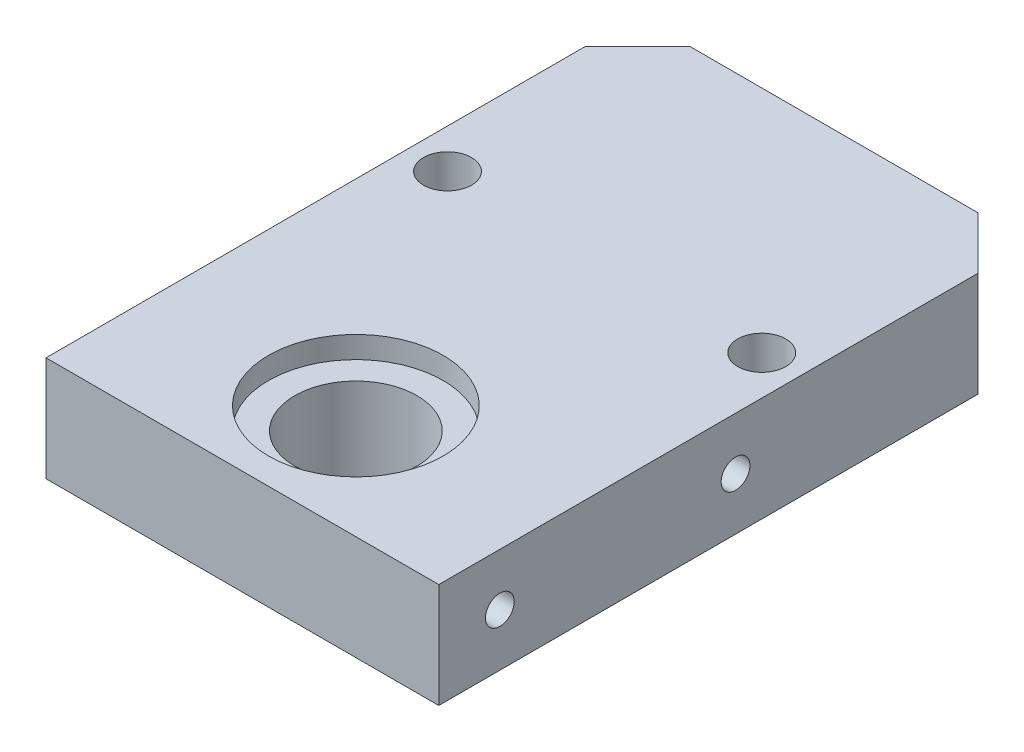
ISO-10303-21;
HEADER;
FILE_DESCRIPTION(('STEP AP214'),'2;1');
FILE_NAME('part.step','',(''),(''),'','','');
FILE_SCHEMA(('AUTOMOTIVE_DESIGN { 1 0 10303 214 1 1 1 1 }'));
ENDSEC;
DATA;
#1=APPLICATION_CONTEXT('core data for automotive mechanical design processes');
#2=APPLICATION_PROTOCOL_DEFINITION('international standard','automotive_design',2000,#1);
#3=PRODUCT_CONTEXT('',#1,'mechanical');
#4=PRODUCT('Part','Part','',(#3));
#5=PRODUCT_RELATED_PRODUCT_CATEGORY('part','',(#4));
#6=PRODUCT_DEFINITION_FORMATION('','',#4);
#7=PRODUCT_DEFINITION_CONTEXT('part definition',#1,'design');
#8=PRODUCT_DEFINITION('design','',#6,#7);
#9=PRODUCT_DEFINITION_SHAPE('','',#8);
#10=(LENGTH_UNIT() NAMED_UNIT(*) SI_UNIT(.MILLI.,.METRE.));
#11=(NAMED_UNIT(*) PLANE_ANGLE_UNIT() SI_UNIT($,.RADIAN.));
#12=(NAMED_UNIT(*) SI_UNIT($,.STERADIAN.) SOLID_ANGLE_UNIT());
#13=UNCERTAINTY_MEASURE_WITH_UNIT(LENGTH_MEASURE(1.E-05),#10,'distance_accuracy_value','');
#14=(GEOMETRIC_REPRESENTATION_CONTEXT(3) GLOBAL_UNCERTAINTY_ASSIGNED_CONTEXT((#13)) GLOBAL_UNIT_ASSIGNED_CONTEXT((#10,
#11,#12)) REPRESENTATION_CONTEXT('',''));
#15=CARTESIAN_POINT('',(0.,0.,0.));
#16=DIRECTION('',(0.,0.,1.));
#17=DIRECTION('',(1.,0.,0.));
#18=AXIS2_PLACEMENT_3D('',#15,#16,#17);
#19=CARTESIAN_POINT('',(0.,12.,20.8888888888888));
#20=DIRECTION('',(0.,-1.,0.));
#21=DIRECTION('',(0.,0.,-1.));
#22=AXIS2_PLACEMENT_3D('',#19,#20,#21);
#23=CYLINDRICAL_SURFACE('',#22,7.);
#24=CARTESIAN_POINT('',(0.,0.,20.8888888888888));
#25=DIRECTION('',(0.,1.,0.));
#26=DIRECTION('',(0.,0.,1.));
#27=AXIS2_PLACEMENT_3D('',#24,#25,#26);
#28=CIRCLE('',#27,7.);
#29=CARTESIAN_POINT('',(0.,0.,27.8888888888888));
#30=VERTEX_POINT('',#29);
#31=EDGE_CURVE('E220',#30,#30,#28,.T.);
#32=ORIENTED_EDGE('',*,*,#31,.F.);
#33=EDGE_LOOP('',(#32));
#34=FACE_BOUND('',#33,.T.);
#35=CARTESIAN_POINT('',(0.,9.5,20.8888888888888));
#36=DIRECTION('',(0.,1.,0.));
#37=DIRECTION('',(0.,0.,1.));
#38=AXIS2_PLACEMENT_3D('',#35,#36,#37);
#39=CIRCLE('',#38,7.);
#40=CARTESIAN_POINT('',(0.,9.5,27.8888888888888));
#41=VERTEX_POINT('',#40);
#42=EDGE_CURVE('E49',#41,#41,#39,.T.);
#43=ORIENTED_EDGE('',*,*,#42,.T.);
#44=EDGE_LOOP('',(#43));
#45=FACE_BOUND('',#44,.T.);
#46=ADVANCED_FACE('F45',(#34,#45),#23,.F.);
#47=CARTESIAN_POINT('',(-22.5,12.,33.8888888888888));
#48=DIRECTION('',(1.,0.,0.));
#49=DIRECTION('',(0.,0.,-1.));
#50=AXIS2_PLACEMENT_3D('',#47,#48,#49);
#51=PLANE('',#50);
#52=CARTESIAN_POINT('',(-22.5,6.,-0.111111111111159));
#53=DIRECTION('',(-1.,0.,0.));
#54=DIRECTION('',(0.,0.,1.));
#55=AXIS2_PLACEMENT_3D('',#52,#53,#54);
#56=CIRCLE('',#55,1.65);
#57=CARTESIAN_POINT('',(-22.5,6.,1.53888888888884));
#58=VERTEX_POINT('',#57);
#59=EDGE_CURVE('E259',#58,#58,#56,.T.);
#60=ORIENTED_EDGE('',*,*,#59,.F.);
#61=EDGE_LOOP('',(#60));
#62=FACE_BOUND('',#61,.T.);
#63=DIRECTION('',(0.,0.,1.));
#64=VECTOR('',#63,1.);
#65=CARTESIAN_POINT('',(-22.5,0.,33.8888888888888));
#66=LINE('',#65,#64);
#67=CARTESIAN_POINT('',(-22.5,0.,-27.8888888888888));
#68=VERTEX_POINT('',#67);
#69=CARTESIAN_POINT('',(-22.5,0.,33.8888888888888));
#70=VERTEX_POINT('',#69);
#71=EDGE_CURVE('E140',#68,#70,#66,.T.);
#72=ORIENTED_EDGE('',*,*,#71,.T.);
#73=DIRECTION('',(0.,-1.,0.));
#74=VECTOR('',#73,1.);
#75=CARTESIAN_POINT('',(-22.5,12.,33.8888888888888));
#76=LINE('',#75,#74);
#77=CARTESIAN_POINT('',(-22.5,12.,33.8888888888888));
#78=VERTEX_POINT('',#77);
#79=EDGE_CURVE('E11',#78,#70,#76,.T.);
#80=ORIENTED_EDGE('',*,*,#79,.F.);
#81=DIRECTION('',(0.,0.,1.));
#82=VECTOR('',#81,1.);
#83=CARTESIAN_POINT('',(-22.5,12.,33.8888888888888));
#84=LINE('',#83,#82);
#85=CARTESIAN_POINT('',(-22.5,12.,-27.8888888888888));
#86=VERTEX_POINT('',#85);
#87=EDGE_CURVE('E157',#86,#78,#84,.T.);
#88=ORIENTED_EDGE('',*,*,#87,.F.);
#89=DIRECTION('',(0.,-1.,0.));
#90=VECTOR('',#89,1.);
#91=CARTESIAN_POINT('',(-22.5,12.,-27.8888888888888));
#92=LINE('',#91,#90);
#93=EDGE_CURVE('E136',#86,#68,#92,.T.);
#94=ORIENTED_EDGE('',*,*,#93,.T.);
#95=EDGE_LOOP('',(#72,#80,#88,#94));
#96=FACE_BOUND('',#95,.T.);
#97=CARTESIAN_POINT('',(-22.5,6.,26.8888888888888));
#98=DIRECTION('',(-1.,0.,0.));
#99=DIRECTION('',(0.,0.,1.));
#100=AXIS2_PLACEMENT_3D('',#97,#98,#99);
#101=CIRCLE('',#100,1.65);
#102=CARTESIAN_POINT('',(-22.5,6.,28.5388888888888));
#103=VERTEX_POINT('',#102);
#104=EDGE_CURVE('E251',#103,#103,#101,.T.);
#105=ORIENTED_EDGE('',*,*,#104,.F.);
#106=EDGE_LOOP('',(#105));
#107=FACE_BOUND('',#106,.T.);
#108=ADVANCED_FACE('F47',(#62,#96,#107),#51,.F.);
#109=CARTESIAN_POINT('',(0.,12.,0.));
#110=DIRECTION('',(0.,-1.,0.));
#111=DIRECTION('',(0.,0.,-1.));
#112=AXIS2_PLACEMENT_3D('',#109,#110,#111);
#113=PLANE('',#112);
#114=CARTESIAN_POINT('',(0.,12.,20.8888888888888));
#115=DIRECTION('',(0.,1.,0.));
#116=DIRECTION('',(0.,0.,1.));
#117=AXIS2_PLACEMENT_3D('',#114,#115,#116);
#118=CIRCLE('',#117,10.);
#119=CARTESIAN_POINT('',(0.,12.,30.8888888888888));
#120=VERTEX_POINT('',#119);
#121=EDGE_CURVE('E279',#120,#120,#118,.T.);
#122=ORIENTED_EDGE('',*,*,#121,.F.);
#123=EDGE_LOOP('',(#122));
#124=FACE_BOUND('',#123,.T.);
#125=ORIENTED_EDGE('',*,*,#87,.T.);
#126=DIRECTION('',(1.,0.,0.));
#127=VECTOR('',#126,1.);
#128=CARTESIAN_POINT('',(-22.5,12.,33.8888888888888));
#129=LINE('',#128,#127);
#130=CARTESIAN_POINT('',(22.5,12.,33.8888888888888));
#131=VERTEX_POINT('',#130);
#132=EDGE_CURVE('E102',#78,#131,#129,.T.);
#133=ORIENTED_EDGE('',*,*,#132,.T.);
#134=DIRECTION('',(0.,0.,-1.));
#135=VECTOR('',#134,1.);
#136=CARTESIAN_POINT('',(22.5,12.,33.8888888888888));
#137=LINE('',#136,#135);
#138=CARTESIAN_POINT('',(22.5,12.,-27.8888888888888));
#139=VERTEX_POINT('',#138);
#140=EDGE_CURVE('E118',#131,#139,#137,.T.);
#141=ORIENTED_EDGE('',*,*,#140,.T.);
#142=DIRECTION('',(-0.707106781186544,0.,-0.707106781186552));
#143=VECTOR('',#142,1.);
#144=CARTESIAN_POINT('',(16.5000000000001,12.,-33.8888888888888));
#145=LINE('',#144,#143);
#146=CARTESIAN_POINT('',(16.5000000000001,12.,-33.8888888888888));
#147=VERTEX_POINT('',#146);
#148=EDGE_CURVE('E111',#139,#147,#145,.T.);
#149=ORIENTED_EDGE('',*,*,#148,.T.);
#150=DIRECTION('',(-1.,0.,0.));
#151=VECTOR('',#150,1.);
#152=CARTESIAN_POINT('',(-16.5000000000001,12.,-33.8888888888888));
#153=LINE('',#152,#151);
#154=CARTESIAN_POINT('',(-16.5000000000001,12.,-33.8888888888888));
#155=VERTEX_POINT('',#154);
#156=EDGE_CURVE('E116',#147,#155,#153,.T.);
#157=ORIENTED_EDGE('',*,*,#156,.T.);
#158=DIRECTION('',(-0.707106781186543,0.,0.707106781186552));
#159=VECTOR('',#158,1.);
#160=CARTESIAN_POINT('',(-16.5000000000001,12.,-33.8888888888888));
#161=LINE('',#160,#159);
#162=EDGE_CURVE('E64',#155,#86,#161,.T.);
#163=ORIENTED_EDGE('',*,*,#162,.T.);
#164=EDGE_LOOP('',(#125,#133,#141,#149,#157,#163));
#165=FACE_BOUND('',#164,.T.);
#166=CARTESIAN_POINT('',(-18.,12.,-7.61111111111116));
#167=DIRECTION('',(0.,1.,0.));
#168=DIRECTION('',(0.,0.,1.));
#169=AXIS2_PLACEMENT_3D('',#166,#167,#168);
#170=CIRCLE('',#169,2.75);
#171=CARTESIAN_POINT('',(-18.,12.,-4.86111111111116));
#172=VERTEX_POINT('',#171);
#173=EDGE_CURVE('E145',#172,#172,#170,.T.);
#174=ORIENTED_EDGE('',*,*,#173,.F.);
#175=EDGE_LOOP('',(#174));
#176=FACE_BOUND('',#175,.T.);
#177=CARTESIAN_POINT('',(18.,12.,-7.61111111111116));
#178=DIRECTION('',(0.,1.,0.));
#179=DIRECTION('',(0.,0.,1.));
#180=AXIS2_PLACEMENT_3D('',#177,#178,#179);
#181=CIRCLE('',#180,2.75);
#182=CARTESIAN_POINT('',(18.,12.,-4.86111111111116));
#183=VERTEX_POINT('',#182);
#184=EDGE_CURVE('E219',#183,#183,#181,.T.);
#185=ORIENTED_EDGE('',*,*,#184,.F.);
#186=EDGE_LOOP('',(#185));
#187=FACE_BOUND('',#186,.T.);
#188=ADVANCED_FACE('F113',(#124,#165,#176,#187),#113,.F.);
#189=CARTESIAN_POINT('',(0.,0.,0.));
#190=DIRECTION('',(0.,-1.,0.));
#191=DIRECTION('',(0.,0.,-1.));
#192=AXIS2_PLACEMENT_3D('',#189,#190,#191);
#193=PLANE('',#192);
#194=CARTESIAN_POINT('',(18.,0.,-7.61111111111116));
#195=DIRECTION('',(0.,1.,0.));
#196=DIRECTION('',(0.,0.,1.));
#197=AXIS2_PLACEMENT_3D('',#194,#195,#196);
#198=CIRCLE('',#197,2.75);
#199=CARTESIAN_POINT('',(18.,0.,-4.86111111111116));
#200=VERTEX_POINT('',#199);
#201=EDGE_CURVE('E216',#200,#200,#198,.T.);
#202=ORIENTED_EDGE('',*,*,#201,.T.);
#203=EDGE_LOOP('',(#202));
#204=FACE_BOUND('',#203,.T.);
#205=ORIENTED_EDGE('',*,*,#71,.F.);
#206=DIRECTION('',(-0.707106781186543,0.,0.707106781186552));
#207=VECTOR('',#206,1.);
#208=CARTESIAN_POINT('',(-16.5000000000001,0.,-33.8888888888888));
#209=LINE('',#208,#207);
#210=CARTESIAN_POINT('',(-16.5000000000001,0.,-33.8888888888888));
#211=VERTEX_POINT('',#210);
#212=EDGE_CURVE('E94',#211,#68,#209,.T.);
#213=ORIENTED_EDGE('',*,*,#212,.F.);
#214=DIRECTION('',(-1.,0.,0.));
#215=VECTOR('',#214,1.);
#216=CARTESIAN_POINT('',(-16.5000000000001,0.,-33.8888888888888));
#217=LINE('',#216,#215);
#218=CARTESIAN_POINT('',(16.5000000000001,0.,-33.8888888888888));
#219=VERTEX_POINT('',#218);
#220=EDGE_CURVE('E88',#219,#211,#217,.T.);
#221=ORIENTED_EDGE('',*,*,#220,.F.);
#222=DIRECTION('',(-0.707106781186544,0.,-0.707106781186552));
#223=VECTOR('',#222,1.);
#224=CARTESIAN_POINT('',(16.5000000000001,0.,-33.8888888888888));
#225=LINE('',#224,#223);
#226=CARTESIAN_POINT('',(22.5,0.,-27.8888888888888));
#227=VERTEX_POINT('',#226);
#228=EDGE_CURVE('E127',#227,#219,#225,.T.);
#229=ORIENTED_EDGE('',*,*,#228,.F.);
#230=DIRECTION('',(0.,0.,-1.));
#231=VECTOR('',#230,1.);
#232=CARTESIAN_POINT('',(22.5,0.,33.8888888888888));
#233=LINE('',#232,#231);
#234=CARTESIAN_POINT('',(22.5,0.,33.8888888888888));
#235=VERTEX_POINT('',#234);
#236=EDGE_CURVE('E148',#235,#227,#233,.T.);
#237=ORIENTED_EDGE('',*,*,#236,.F.);
#238=DIRECTION('',(1.,0.,0.));
#239=VECTOR('',#238,1.);
#240=CARTESIAN_POINT('',(-22.5,0.,33.8888888888888));
#241=LINE('',#240,#239);
#242=EDGE_CURVE('E144',#70,#235,#241,.T.);
#243=ORIENTED_EDGE('',*,*,#242,.F.);
#244=EDGE_LOOP('',(#205,#213,#221,#229,#237,#243));
#245=FACE_BOUND('',#244,.T.);
#246=CARTESIAN_POINT('',(-18.,0.,-7.61111111111116));
#247=DIRECTION('',(0.,1.,0.));
#248=DIRECTION('',(0.,0.,1.));
#249=AXIS2_PLACEMENT_3D('',#246,#247,#248);
#250=CIRCLE('',#249,2.75);
#251=CARTESIAN_POINT('',(-18.,0.,-4.86111111111116));
#252=VERTEX_POINT('',#251);
#253=EDGE_CURVE('E225',#252,#252,#250,.T.);
#254=ORIENTED_EDGE('',*,*,#253,.T.);
#255=EDGE_LOOP('',(#254));
#256=FACE_BOUND('',#255,.T.);
#257=ORIENTED_EDGE('',*,*,#31,.T.);
#258=EDGE_LOOP('',(#257));
#259=FACE_BOUND('',#258,.T.);
#260=ADVANCED_FACE('F171',(#204,#245,#256,#259),#193,.T.);
#261=CARTESIAN_POINT('',(-22.5,12.,33.8888888888888));
#262=DIRECTION('',(0.,0.,-1.));
#263=DIRECTION('',(-1.,0.,0.));
#264=AXIS2_PLACEMENT_3D('',#261,#262,#263);
#265=PLANE('',#264);
#266=ORIENTED_EDGE('',*,*,#242,.T.);
#267=DIRECTION('',(0.,-1.,0.));
#268=VECTOR('',#267,1.);
#269=CARTESIAN_POINT('',(22.5,12.,33.8888888888888));
#270=LINE('',#269,#268);
#271=EDGE_CURVE('E56',#131,#235,#270,.T.);
#272=ORIENTED_EDGE('',*,*,#271,.F.);
#273=ORIENTED_EDGE('',*,*,#132,.F.);
#274=ORIENTED_EDGE('',*,*,#79,.T.);
#275=EDGE_LOOP('',(#266,#272,#273,#274));
#276=FACE_BOUND('',#275,.T.);
#277=ADVANCED_FACE('F209',(#276),#265,.F.);
#278=CARTESIAN_POINT('',(22.5,12.,33.8888888888888));
#279=DIRECTION('',(-1.,0.,0.));
#280=DIRECTION('',(0.,0.,1.));
#281=AXIS2_PLACEMENT_3D('',#278,#279,#280);
#282=PLANE('',#281);
#283=CARTESIAN_POINT('',(22.5,6.,26.8888888888888));
#284=DIRECTION('',(1.,0.,0.));
#285=DIRECTION('',(0.,0.,-1.));
#286=AXIS2_PLACEMENT_3D('',#283,#284,#285);
#287=CIRCLE('',#286,1.64999999999999);
#288=CARTESIAN_POINT('',(22.5,6.,25.2388888888889));
#289=VERTEX_POINT('',#288);
#290=EDGE_CURVE('E275',#289,#289,#287,.T.);
#291=ORIENTED_EDGE('',*,*,#290,.F.);
#292=EDGE_LOOP('',(#291));
#293=FACE_BOUND('',#292,.T.);
#294=CARTESIAN_POINT('',(22.5,6.,-0.111111111111156));
#295=DIRECTION('',(1.,0.,0.));
#296=DIRECTION('',(0.,0.,-1.));
#297=AXIS2_PLACEMENT_3D('',#294,#295,#296);
#298=CIRCLE('',#297,1.64999999999999);
#299=CARTESIAN_POINT('',(22.5,6.,-1.76111111111115));
#300=VERTEX_POINT('',#299);
#301=EDGE_CURVE('E267',#300,#300,#298,.T.);
#302=ORIENTED_EDGE('',*,*,#301,.F.);
#303=EDGE_LOOP('',(#302));
#304=FACE_BOUND('',#303,.T.);
#305=ORIENTED_EDGE('',*,*,#236,.T.);
#306=DIRECTION('',(0.,-1.,0.));
#307=VECTOR('',#306,1.);
#308=CARTESIAN_POINT('',(22.5,12.,-27.8888888888888));
#309=LINE('',#308,#307);
#310=EDGE_CURVE('E129',#139,#227,#309,.T.);
#311=ORIENTED_EDGE('',*,*,#310,.F.);
#312=ORIENTED_EDGE('',*,*,#140,.F.);
#313=ORIENTED_EDGE('',*,*,#271,.T.);
#314=EDGE_LOOP('',(#305,#311,#312,#313));
#315=FACE_BOUND('',#314,.T.);
#316=ADVANCED_FACE('F168',(#293,#304,#315),#282,.F.);
#317=CARTESIAN_POINT('',(16.5000000000001,12.,-33.8888888888888));
#318=DIRECTION('',(-0.707106781186551,0.,0.707106781186543));
#319=DIRECTION('',(0.707106781186544,0.,0.707106781186552));
#320=AXIS2_PLACEMENT_3D('',#317,#318,#319);
#321=PLANE('',#320);
#322=ORIENTED_EDGE('',*,*,#228,.T.);
#323=DIRECTION('',(0.,-1.,0.));
#324=VECTOR('',#323,1.);
#325=CARTESIAN_POINT('',(16.5000000000001,12.,-33.8888888888888));
#326=LINE('',#325,#324);
#327=EDGE_CURVE('E124',#147,#219,#326,.T.);
#328=ORIENTED_EDGE('',*,*,#327,.F.);
#329=ORIENTED_EDGE('',*,*,#148,.F.);
#330=ORIENTED_EDGE('',*,*,#310,.T.);
#331=EDGE_LOOP('',(#322,#328,#329,#330));
#332=FACE_BOUND('',#331,.T.);
#333=ADVANCED_FACE('F125',(#332),#321,.F.);
#334=CARTESIAN_POINT('',(-16.5000000000001,12.,-33.8888888888888));
#335=DIRECTION('',(0.,0.,1.));
#336=DIRECTION('',(1.,0.,0.));
#337=AXIS2_PLACEMENT_3D('',#334,#335,#336);
#338=PLANE('',#337);
#339=ORIENTED_EDGE('',*,*,#220,.T.);
#340=DIRECTION('',(0.,-1.,0.));
#341=VECTOR('',#340,1.);
#342=CARTESIAN_POINT('',(-16.5000000000001,12.,-33.8888888888888));
#343=LINE('',#342,#341);
#344=EDGE_CURVE('E130',#155,#211,#343,.T.);
#345=ORIENTED_EDGE('',*,*,#344,.F.);
#346=ORIENTED_EDGE('',*,*,#156,.F.);
#347=ORIENTED_EDGE('',*,*,#327,.T.);
#348=EDGE_LOOP('',(#339,#345,#346,#347));
#349=FACE_BOUND('',#348,.T.);
#350=ADVANCED_FACE('F132',(#349),#338,.F.);
#351=CARTESIAN_POINT('',(-16.5000000000001,12.,-33.8888888888888));
#352=DIRECTION('',(0.707106781186552,0.,0.707106781186543));
#353=DIRECTION('',(0.707106781186543,0.,-0.707106781186552));
#354=AXIS2_PLACEMENT_3D('',#351,#352,#353);
#355=PLANE('',#354);
#356=ORIENTED_EDGE('',*,*,#212,.T.);
#357=ORIENTED_EDGE('',*,*,#93,.F.);
#358=ORIENTED_EDGE('',*,*,#162,.F.);
#359=ORIENTED_EDGE('',*,*,#344,.T.);
#360=EDGE_LOOP('',(#356,#357,#358,#359));
#361=FACE_BOUND('',#360,.T.);
#362=ADVANCED_FACE('F177',(#361),#355,.F.);
#363=CARTESIAN_POINT('',(-18.,12.,-7.61111111111116));
#364=DIRECTION('',(0.,-1.,0.));
#365=DIRECTION('',(0.,0.,-1.));
#366=AXIS2_PLACEMENT_3D('',#363,#364,#365);
#367=CYLINDRICAL_SURFACE('',#366,2.75);
#368=ORIENTED_EDGE('',*,*,#173,.T.);
#369=EDGE_LOOP('',(#368));
#370=FACE_BOUND('',#369,.T.);
#371=ORIENTED_EDGE('',*,*,#253,.F.);
#372=EDGE_LOOP('',(#371));
#373=FACE_BOUND('',#372,.T.);
#374=ADVANCED_FACE('F179',(#370,#373),#367,.F.);
#375=CARTESIAN_POINT('',(18.,12.,-7.61111111111116));
#376=DIRECTION('',(0.,-1.,0.));
#377=DIRECTION('',(0.,0.,-1.));
#378=AXIS2_PLACEMENT_3D('',#375,#376,#377);
#379=CYLINDRICAL_SURFACE('',#378,2.75);
#380=ORIENTED_EDGE('',*,*,#184,.T.);
#381=EDGE_LOOP('',(#380));
#382=FACE_BOUND('',#381,.T.);
#383=ORIENTED_EDGE('',*,*,#201,.F.);
#384=EDGE_LOOP('',(#383));
#385=FACE_BOUND('',#384,.T.);
#386=ADVANCED_FACE('F185',(#382,#385),#379,.F.);
#387=CARTESIAN_POINT('',(-8.5,6.,26.8888888888888));
#388=DIRECTION('',(-1.,0.,0.));
#389=DIRECTION('',(0.,0.,1.));
#390=AXIS2_PLACEMENT_3D('',#387,#388,#389);
#391=CONICAL_SURFACE('',#390,1.65,1.02974425867665);
#392=CARTESIAN_POINT('',(-7.50857997860452,6.,26.8888888888888));
#393=VERTEX_POINT('',#392);
#394=VERTEX_LOOP('',#393);
#395=FACE_BOUND('',#394,.T.);
#396=CARTESIAN_POINT('',(-8.5,6.,26.8888888888888));
#397=DIRECTION('',(-1.,0.,0.));
#398=DIRECTION('',(0.,0.,1.));
#399=AXIS2_PLACEMENT_3D('',#396,#397,#398);
#400=CIRCLE('',#399,1.65);
#401=CARTESIAN_POINT('',(-8.5,6.,28.5388888888888));
#402=VERTEX_POINT('',#401);
#403=EDGE_CURVE('E228',#402,#402,#400,.T.);
#404=ORIENTED_EDGE('',*,*,#403,.T.);
#405=EDGE_LOOP('',(#404));
#406=FACE_BOUND('',#405,.T.);
#407=ADVANCED_FACE('F201',(#395,#406),#391,.F.);
#408=CARTESIAN_POINT('',(-22.5,6.,26.8888888888888));
#409=DIRECTION('',(-1.,0.,0.));
#410=DIRECTION('',(0.,0.,1.));
#411=AXIS2_PLACEMENT_3D('',#408,#409,#410);
#412=CYLINDRICAL_SURFACE('',#411,1.65);
#413=ORIENTED_EDGE('',*,*,#403,.F.);
#414=EDGE_LOOP('',(#413));
#415=FACE_BOUND('',#414,.T.);
#416=ORIENTED_EDGE('',*,*,#104,.T.);
#417=EDGE_LOOP('',(#416));
#418=FACE_BOUND('',#417,.T.);
#419=ADVANCED_FACE('F324',(#415,#418),#412,.F.);
#420=CARTESIAN_POINT('',(-8.5,6.,-0.111111111111159));
#421=DIRECTION('',(-1.,0.,0.));
#422=DIRECTION('',(0.,0.,1.));
#423=AXIS2_PLACEMENT_3D('',#420,#421,#422);
#424=CONICAL_SURFACE('',#423,1.65,1.02974425867665);
#425=CARTESIAN_POINT('',(-7.50857997860452,6.,-0.111111111111159));
#426=VERTEX_POINT('',#425);
#427=VERTEX_LOOP('',#426);
#428=FACE_BOUND('',#427,.T.);
#429=CARTESIAN_POINT('',(-8.5,6.,-0.111111111111159));
#430=DIRECTION('',(-1.,0.,0.));
#431=DIRECTION('',(0.,0.,1.));
#432=AXIS2_PLACEMENT_3D('',#429,#430,#431);
#433=CIRCLE('',#432,1.65);
#434=CARTESIAN_POINT('',(-8.5,6.,1.53888888888884));
#435=VERTEX_POINT('',#434);
#436=EDGE_CURVE('E255',#435,#435,#433,.T.);
#437=ORIENTED_EDGE('',*,*,#436,.T.);
#438=EDGE_LOOP('',(#437));
#439=FACE_BOUND('',#438,.T.);
#440=ADVANCED_FACE('F321',(#428,#439),#424,.F.);
#441=CARTESIAN_POINT('',(-22.5,6.,-0.111111111111159));
#442=DIRECTION('',(-1.,0.,0.));
#443=DIRECTION('',(0.,0.,1.));
#444=AXIS2_PLACEMENT_3D('',#441,#442,#443);
#445=CYLINDRICAL_SURFACE('',#444,1.65);
#446=ORIENTED_EDGE('',*,*,#436,.F.);
#447=EDGE_LOOP('',(#446));
#448=FACE_BOUND('',#447,.T.);
#449=ORIENTED_EDGE('',*,*,#59,.T.);
#450=EDGE_LOOP('',(#449));
#451=FACE_BOUND('',#450,.T.);
#452=ADVANCED_FACE('F317',(#448,#451),#445,.F.);
#453=CARTESIAN_POINT('',(8.5,6.,-0.111111111111156));
#454=DIRECTION('',(1.,0.,0.));
#455=DIRECTION('',(0.,0.,-1.));
#456=AXIS2_PLACEMENT_3D('',#453,#454,#455);
#457=CONICAL_SURFACE('',#456,1.64999999999999,1.02974425867665);
#458=CARTESIAN_POINT('',(7.50857997860453,6.,-0.111111111111156));
#459=VERTEX_POINT('',#458);
#460=VERTEX_LOOP('',#459);
#461=FACE_BOUND('',#460,.T.);
#462=CARTESIAN_POINT('',(8.5,6.,-0.111111111111156));
#463=DIRECTION('',(1.,0.,0.));
#464=DIRECTION('',(0.,0.,-1.));
#465=AXIS2_PLACEMENT_3D('',#462,#463,#464);
#466=CIRCLE('',#465,1.64999999999999);
#467=CARTESIAN_POINT('',(8.5,6.,-1.76111111111114));
#468=VERTEX_POINT('',#467);
#469=EDGE_CURVE('E263',#468,#468,#466,.T.);
#470=ORIENTED_EDGE('',*,*,#469,.T.);
#471=EDGE_LOOP('',(#470));
#472=FACE_BOUND('',#471,.T.);
#473=ADVANCED_FACE('F313',(#461,#472),#457,.F.);
#474=CARTESIAN_POINT('',(22.5,6.,-0.111111111111156));
#475=DIRECTION('',(1.,0.,0.));
#476=DIRECTION('',(0.,0.,-1.));
#477=AXIS2_PLACEMENT_3D('',#474,#475,#476);
#478=CYLINDRICAL_SURFACE('',#477,1.64999999999999);
#479=ORIENTED_EDGE('',*,*,#469,.F.);
#480=EDGE_LOOP('',(#479));
#481=FACE_BOUND('',#480,.T.);
#482=ORIENTED_EDGE('',*,*,#301,.T.);
#483=EDGE_LOOP('',(#482));
#484=FACE_BOUND('',#483,.T.);
#485=ADVANCED_FACE('F309',(#481,#484),#478,.F.);
#486=CARTESIAN_POINT('',(8.5,6.,26.8888888888888));
#487=DIRECTION('',(1.,0.,0.));
#488=DIRECTION('',(0.,0.,-1.));
#489=AXIS2_PLACEMENT_3D('',#486,#487,#488);
#490=CONICAL_SURFACE('',#489,1.64999999999999,1.02974425867665);
#491=CARTESIAN_POINT('',(7.50857997860453,6.,26.8888888888888));
#492=VERTEX_POINT('',#491);
#493=VERTEX_LOOP('',#492);
#494=FACE_BOUND('',#493,.T.);
#495=CARTESIAN_POINT('',(8.5,6.,26.8888888888888));
#496=DIRECTION('',(1.,0.,0.));
#497=DIRECTION('',(0.,0.,-1.));
#498=AXIS2_PLACEMENT_3D('',#495,#496,#497);
#499=CIRCLE('',#498,1.64999999999999);
#500=CARTESIAN_POINT('',(8.5,6.,25.2388888888889));
#501=VERTEX_POINT('',#500);
#502=EDGE_CURVE('E271',#501,#501,#499,.T.);
#503=ORIENTED_EDGE('',*,*,#502,.T.);
#504=EDGE_LOOP('',(#503));
#505=FACE_BOUND('',#504,.T.);
#506=ADVANCED_FACE('F305',(#494,#505),#490,.F.);
#507=CARTESIAN_POINT('',(22.5,6.,26.8888888888888));
#508=DIRECTION('',(1.,0.,0.));
#509=DIRECTION('',(0.,0.,-1.));
#510=AXIS2_PLACEMENT_3D('',#507,#508,#509);
#511=CYLINDRICAL_SURFACE('',#510,1.64999999999999);
#512=ORIENTED_EDGE('',*,*,#502,.F.);
#513=EDGE_LOOP('',(#512));
#514=FACE_BOUND('',#513,.T.);
#515=ORIENTED_EDGE('',*,*,#290,.T.);
#516=EDGE_LOOP('',(#515));
#517=FACE_BOUND('',#516,.T.);
#518=ADVANCED_FACE('F299',(#514,#517),#511,.F.);
#519=CARTESIAN_POINT('',(0.,9.5,20.8888888888888));
#520=DIRECTION('',(0.,1.,0.));
#521=DIRECTION('',(0.,0.,1.));
#522=AXIS2_PLACEMENT_3D('',#519,#520,#521);
#523=CYLINDRICAL_SURFACE('',#522,10.);
#524=CARTESIAN_POINT('',(0.,9.5,20.8888888888888));
#525=DIRECTION('',(0.,1.,0.));
#526=DIRECTION('',(0.,0.,1.));
#527=AXIS2_PLACEMENT_3D('',#524,#525,#526);
#528=CIRCLE('',#527,10.);
#529=CARTESIAN_POINT('',(0.,9.5,30.8888888888888));
#530=VERTEX_POINT('',#529);
#531=EDGE_CURVE('E283',#530,#530,#528,.T.);
#532=ORIENTED_EDGE('',*,*,#531,.F.);
#533=EDGE_LOOP('',(#532));
#534=FACE_BOUND('',#533,.T.);
#535=ORIENTED_EDGE('',*,*,#121,.T.);
#536=EDGE_LOOP('',(#535));
#537=FACE_BOUND('',#536,.T.);
#538=ADVANCED_FACE('F294',(#534,#537),#523,.F.);
#539=CARTESIAN_POINT('',(0.,9.5,20.8888888888888));
#540=DIRECTION('',(0.,1.,0.));
#541=DIRECTION('',(0.,0.,1.));
#542=AXIS2_PLACEMENT_3D('',#539,#540,#541);
#543=PLANE('',#542);
#544=ORIENTED_EDGE('',*,*,#42,.F.);
#545=EDGE_LOOP('',(#544));
#546=FACE_BOUND('',#545,.T.);
#547=ORIENTED_EDGE('',*,*,#531,.T.);
#548=EDGE_LOOP('',(#547));
#549=FACE_BOUND('',#548,.T.);
#550=ADVANCED_FACE('F292',(#546,#549),#543,.T.);
#551=CLOSED_SHELL('',(#46,#108,#188,#260,#277,#316,#333,#350,#362,#374,#386,#407,#419,#440,#452,
#473,#485,#506,#518,#538,#550));
#552=MANIFOLD_SOLID_BREP('B2',#551);
#553=ADVANCED_BREP_SHAPE_REPRESENTATION('',(#18,#552),#14);
#554=SHAPE_DEFINITION_REPRESENTATION(#9,#553);
ENDSEC;
END-ISO-10303-21;
